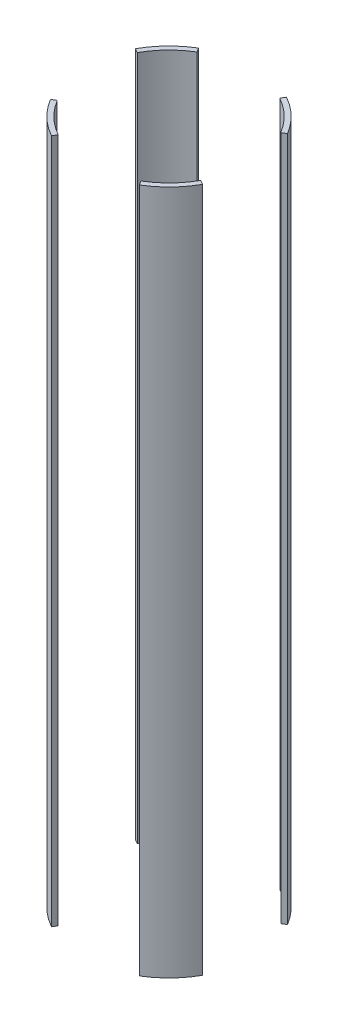
ISO-10303-21;
HEADER;
FILE_DESCRIPTION(('STEP AP214'),'2;1');
FILE_NAME('part.step','',(''),(''),'','','');
FILE_SCHEMA(('AUTOMOTIVE_DESIGN { 1 0 10303 214 1 1 1 1 }'));
ENDSEC;
DATA;
#1=APPLICATION_CONTEXT('core data for automotive mechanical design processes');
#2=APPLICATION_PROTOCOL_DEFINITION('international standard','automotive_design',2000,#1);
#3=PRODUCT_CONTEXT('',#1,'mechanical');
#4=PRODUCT('Part','Part','',(#3));
#5=PRODUCT_RELATED_PRODUCT_CATEGORY('part','',(#4));
#6=PRODUCT_DEFINITION_FORMATION('','',#4);
#7=PRODUCT_DEFINITION_CONTEXT('part definition',#1,'design');
#8=PRODUCT_DEFINITION('design','',#6,#7);
#9=PRODUCT_DEFINITION_SHAPE('','',#8);
#10=(LENGTH_UNIT() NAMED_UNIT(*) SI_UNIT(.MILLI.,.METRE.));
#11=(NAMED_UNIT(*) PLANE_ANGLE_UNIT() SI_UNIT($,.RADIAN.));
#12=(NAMED_UNIT(*) SI_UNIT($,.STERADIAN.) SOLID_ANGLE_UNIT());
#13=UNCERTAINTY_MEASURE_WITH_UNIT(LENGTH_MEASURE(1.E-05),#10,'distance_accuracy_value','');
#14=(GEOMETRIC_REPRESENTATION_CONTEXT(3) GLOBAL_UNCERTAINTY_ASSIGNED_CONTEXT((#13)) GLOBAL_UNIT_ASSIGNED_CONTEXT((#10,
#11,#12)) REPRESENTATION_CONTEXT('',''));
#15=CARTESIAN_POINT('',(0.,0.,0.));
#16=DIRECTION('',(0.,0.,1.));
#17=DIRECTION('',(1.,0.,0.));
#18=AXIS2_PLACEMENT_3D('',#15,#16,#17);
#19=CARTESIAN_POINT('',(0.,-352.425,0.));
#20=DIRECTION('',(0.,1.,0.));
#21=DIRECTION('',(0.,0.,1.));
#22=AXIS2_PLACEMENT_3D('',#19,#20,#21);
#23=PLANE('',#22);
#24=DIRECTION('',(0.48581550952375,0.,-0.874061376967418));
#25=VECTOR('',#24,1.);
#26=CARTESIAN_POINT('',(0.,-352.425,0.));
#27=LINE('',#26,#25);
#28=CARTESIAN_POINT('',(-43.1889987966614,-352.425,77.7040564124034));
#29=VERTEX_POINT('',#28);
#30=CARTESIAN_POINT('',(-40.7210560082808,-352.425,73.263824617409));
#31=VERTEX_POINT('',#30);
#32=EDGE_CURVE('E13',#29,#31,#27,.T.);
#33=ORIENTED_EDGE('',*,*,#32,.F.);
#34=CARTESIAN_POINT('',(0.,-352.425,0.));
#35=DIRECTION('',(0.,1.,0.));
#36=DIRECTION('',(0.,0.,1.));
#37=AXIS2_PLACEMENT_3D('',#34,#35,#36);
#38=CIRCLE('',#37,88.9);
#39=CARTESIAN_POINT('',(-76.2547983281261,-352.425,45.6991874319097));
#40=VERTEX_POINT('',#39);
#41=EDGE_CURVE('E276',#40,#29,#38,.T.);
#42=ORIENTED_EDGE('',*,*,#41,.F.);
#43=DIRECTION('',(0.857759261283758,0.,-0.514051602158714));
#44=VECTOR('',#43,1.);
#45=CARTESIAN_POINT('',(0.,-352.425,0.));
#46=LINE('',#45,#44);
#47=CARTESIAN_POINT('',(-71.8973812808046,-352.425,43.0878052929434));
#48=VERTEX_POINT('',#47);
#49=EDGE_CURVE('E271',#40,#48,#46,.T.);
#50=ORIENTED_EDGE('',*,*,#49,.T.);
#51=CARTESIAN_POINT('',(0.,-352.425,0.));
#52=DIRECTION('',(0.,1.,0.));
#53=DIRECTION('',(0.,0.,1.));
#54=AXIS2_PLACEMENT_3D('',#51,#52,#53);
#55=CIRCLE('',#54,83.82);
#56=EDGE_CURVE('E230',#48,#31,#55,.T.);
#57=ORIENTED_EDGE('',*,*,#56,.T.);
#58=EDGE_LOOP('',(#33,#42,#50,#57));
#59=FACE_BOUND('',#58,.T.);
#60=ADVANCED_FACE('F227',(#59),#23,.F.);
#61=CARTESIAN_POINT('',(0.,352.425,0.));
#62=DIRECTION('',(0.,1.,0.));
#63=DIRECTION('',(0.,0.,1.));
#64=AXIS2_PLACEMENT_3D('',#61,#62,#63);
#65=PLANE('',#64);
#66=CARTESIAN_POINT('',(0.,352.425,0.));
#67=DIRECTION('',(0.,1.,0.));
#68=DIRECTION('',(0.,0.,1.));
#69=AXIS2_PLACEMENT_3D('',#66,#67,#68);
#70=CIRCLE('',#69,88.9);
#71=CARTESIAN_POINT('',(-76.2547983281261,352.425,45.6991874319097));
#72=VERTEX_POINT('',#71);
#73=CARTESIAN_POINT('',(-43.1889987966614,352.425,77.7040564124034));
#74=VERTEX_POINT('',#73);
#75=EDGE_CURVE('E282',#72,#74,#70,.T.);
#76=ORIENTED_EDGE('',*,*,#75,.T.);
#77=DIRECTION('',(0.48581550952375,0.,-0.874061376967418));
#78=VECTOR('',#77,1.);
#79=CARTESIAN_POINT('',(0.,352.425,0.));
#80=LINE('',#79,#78);
#81=CARTESIAN_POINT('',(-40.7210560082808,352.425,73.263824617409));
#82=VERTEX_POINT('',#81);
#83=EDGE_CURVE('E243',#74,#82,#80,.T.);
#84=ORIENTED_EDGE('',*,*,#83,.T.);
#85=CARTESIAN_POINT('',(0.,352.425,0.));
#86=DIRECTION('',(0.,1.,0.));
#87=DIRECTION('',(0.,0.,1.));
#88=AXIS2_PLACEMENT_3D('',#85,#86,#87);
#89=CIRCLE('',#88,83.82);
#90=CARTESIAN_POINT('',(-71.8973812808046,352.425,43.0878052929434));
#91=VERTEX_POINT('',#90);
#92=EDGE_CURVE('E284',#91,#82,#89,.T.);
#93=ORIENTED_EDGE('',*,*,#92,.F.);
#94=DIRECTION('',(0.857759261283758,0.,-0.514051602158714));
#95=VECTOR('',#94,1.);
#96=CARTESIAN_POINT('',(0.,352.425,0.));
#97=LINE('',#96,#95);
#98=EDGE_CURVE('E268',#72,#91,#97,.T.);
#99=ORIENTED_EDGE('',*,*,#98,.F.);
#100=EDGE_LOOP('',(#76,#84,#93,#99));
#101=FACE_BOUND('',#100,.T.);
#102=ADVANCED_FACE('F281',(#101),#65,.T.);
#103=CARTESIAN_POINT('',(0.,352.425,0.));
#104=DIRECTION('',(0.,-1.,0.));
#105=DIRECTION('',(0.,0.,-1.));
#106=AXIS2_PLACEMENT_3D('',#103,#104,#105);
#107=CYLINDRICAL_SURFACE('',#106,88.9);
#108=DIRECTION('',(0.,-1.,0.));
#109=VECTOR('',#108,1.);
#110=CARTESIAN_POINT('',(-43.1889987966614,352.425,77.7040564124034));
#111=LINE('',#110,#109);
#112=EDGE_CURVE('E235',#74,#29,#111,.T.);
#113=ORIENTED_EDGE('',*,*,#112,.F.);
#114=ORIENTED_EDGE('',*,*,#75,.F.);
#115=DIRECTION('',(0.,-1.,0.));
#116=VECTOR('',#115,1.);
#117=CARTESIAN_POINT('',(-76.2547983281261,352.425,45.6991874319097));
#118=LINE('',#117,#116);
#119=EDGE_CURVE('E265',#72,#40,#118,.T.);
#120=ORIENTED_EDGE('',*,*,#119,.T.);
#121=ORIENTED_EDGE('',*,*,#41,.T.);
#122=EDGE_LOOP('',(#113,#114,#120,#121));
#123=FACE_BOUND('',#122,.T.);
#124=ADVANCED_FACE('F287',(#123),#107,.T.);
#125=CARTESIAN_POINT('',(0.,352.425,0.));
#126=DIRECTION('',(0.,-1.,0.));
#127=DIRECTION('',(0.,0.,-1.));
#128=AXIS2_PLACEMENT_3D('',#125,#126,#127);
#129=CYLINDRICAL_SURFACE('',#128,83.82);
#130=ORIENTED_EDGE('',*,*,#92,.T.);
#131=DIRECTION('',(0.,-1.,0.));
#132=VECTOR('',#131,1.);
#133=CARTESIAN_POINT('',(-40.7210560082807,352.425,73.2638246174089));
#134=LINE('',#133,#132);
#135=EDGE_CURVE('E247',#82,#31,#134,.T.);
#136=ORIENTED_EDGE('',*,*,#135,.T.);
#137=ORIENTED_EDGE('',*,*,#56,.F.);
#138=DIRECTION('',(0.,-1.,0.));
#139=VECTOR('',#138,1.);
#140=CARTESIAN_POINT('',(-71.8973812808046,352.425,43.0878052929434));
#141=LINE('',#140,#139);
#142=EDGE_CURVE('E285',#91,#48,#141,.T.);
#143=ORIENTED_EDGE('',*,*,#142,.F.);
#144=EDGE_LOOP('',(#130,#136,#137,#143));
#145=FACE_BOUND('',#144,.T.);
#146=ADVANCED_FACE('F301',(#145),#129,.F.);
#147=CARTESIAN_POINT('',(0.,-352.425,0.));
#148=DIRECTION('',(0.514051602158714,0.,0.857759261283758));
#149=DIRECTION('',(0.857759261283758,0.,-0.514051602158714));
#150=AXIS2_PLACEMENT_3D('',#147,#148,#149);
#151=PLANE('',#150);
#152=ORIENTED_EDGE('',*,*,#142,.T.);
#153=ORIENTED_EDGE('',*,*,#49,.F.);
#154=ORIENTED_EDGE('',*,*,#119,.F.);
#155=ORIENTED_EDGE('',*,*,#98,.T.);
#156=EDGE_LOOP('',(#152,#153,#154,#155));
#157=FACE_BOUND('',#156,.T.);
#158=ADVANCED_FACE('F267',(#157),#151,.F.);
#159=CARTESIAN_POINT('',(0.,-352.425,0.));
#160=DIRECTION('',(0.874061376967418,0.,0.48581550952375));
#161=DIRECTION('',(0.48581550952375,0.,-0.874061376967418));
#162=AXIS2_PLACEMENT_3D('',#159,#160,#161);
#163=PLANE('',#162);
#164=ORIENTED_EDGE('',*,*,#112,.T.);
#165=ORIENTED_EDGE('',*,*,#32,.T.);
#166=ORIENTED_EDGE('',*,*,#135,.F.);
#167=ORIENTED_EDGE('',*,*,#83,.F.);
#168=EDGE_LOOP('',(#164,#165,#166,#167));
#169=FACE_BOUND('',#168,.T.);
#170=ADVANCED_FACE('F299',(#169),#163,.T.);
#171=CLOSED_SHELL('',(#60,#102,#124,#146,#158,#170));
#172=MANIFOLD_SOLID_BREP('B2',#171);
#173=CARTESIAN_POINT('',(0.,352.425,0.));
#174=DIRECTION('',(0.,-1.,0.));
#175=DIRECTION('',(0.,0.,-1.));
#176=AXIS2_PLACEMENT_3D('',#173,#174,#175);
#177=CYLINDRICAL_SURFACE('',#176,83.82);
#178=DIRECTION('',(0.,-1.,0.));
#179=VECTOR('',#178,1.);
#180=CARTESIAN_POINT('',(-73.2638246174091,352.425,-40.7210560082805));
#181=LINE('',#180,#179);
#182=CARTESIAN_POINT('',(-73.2638246174091,-352.425,-40.7210560082805));
#183=VERTEX_POINT('',#182);
#184=CARTESIAN_POINT('',(-73.2638246174091,352.425,-40.7210560082805));
#185=VERTEX_POINT('',#184);
#186=EDGE_CURVE('E369',#183,#185,#181,.F.);
#187=ORIENTED_EDGE('',*,*,#186,.F.);
#188=CARTESIAN_POINT('',(0.,-352.425,0.));
#189=DIRECTION('',(0.,1.,0.));
#190=DIRECTION('',(0.,0.,1.));
#191=AXIS2_PLACEMENT_3D('',#188,#189,#190);
#192=CIRCLE('',#191,83.82);
#193=CARTESIAN_POINT('',(-43.0878052929431,-352.425,-71.8973812808048));
#194=VERTEX_POINT('',#193);
#195=EDGE_CURVE('E363',#194,#183,#192,.T.);
#196=ORIENTED_EDGE('',*,*,#195,.F.);
#197=DIRECTION('',(0.,-1.,0.));
#198=VECTOR('',#197,1.);
#199=CARTESIAN_POINT('',(-43.0878052929431,352.425,-71.8973812808048));
#200=LINE('',#199,#198);
#201=CARTESIAN_POINT('',(-43.0878052929431,352.425,-71.8973812808048));
#202=VERTEX_POINT('',#201);
#203=EDGE_CURVE('E417',#202,#194,#200,.T.);
#204=ORIENTED_EDGE('',*,*,#203,.F.);
#205=CARTESIAN_POINT('',(0.,352.425,0.));
#206=DIRECTION('',(0.,1.,0.));
#207=DIRECTION('',(0.,0.,1.));
#208=AXIS2_PLACEMENT_3D('',#205,#206,#207);
#209=CIRCLE('',#208,83.82);
#210=EDGE_CURVE('E423',#202,#185,#209,.T.);
#211=ORIENTED_EDGE('',*,*,#210,.T.);
#212=EDGE_LOOP('',(#187,#196,#204,#211));
#213=FACE_BOUND('',#212,.T.);
#214=ADVANCED_FACE('F360',(#213),#177,.F.);
#215=CARTESIAN_POINT('',(0.,352.425,0.));
#216=DIRECTION('',(0.,-1.,0.));
#217=DIRECTION('',(0.,0.,-1.));
#218=AXIS2_PLACEMENT_3D('',#215,#216,#217);
#219=CYLINDRICAL_SURFACE('',#218,88.9);
#220=CARTESIAN_POINT('',(0.,-352.425,0.));
#221=DIRECTION('',(0.,1.,0.));
#222=DIRECTION('',(0.,0.,1.));
#223=AXIS2_PLACEMENT_3D('',#220,#221,#222);
#224=CIRCLE('',#223,88.9);
#225=CARTESIAN_POINT('',(-45.6991874319094,-352.425,-76.2547983281263));
#226=VERTEX_POINT('',#225);
#227=CARTESIAN_POINT('',(-77.7040564124036,-352.425,-43.1889987966612));
#228=VERTEX_POINT('',#227);
#229=EDGE_CURVE('E409',#226,#228,#224,.T.);
#230=ORIENTED_EDGE('',*,*,#229,.T.);
#231=DIRECTION('',(0.,-1.,0.));
#232=VECTOR('',#231,1.);
#233=CARTESIAN_POINT('',(-77.7040564124036,352.425,-43.1889987966611));
#234=LINE('',#233,#232);
#235=CARTESIAN_POINT('',(-77.7040564124036,352.425,-43.1889987966612));
#236=VERTEX_POINT('',#235);
#237=EDGE_CURVE('E397',#228,#236,#234,.F.);
#238=ORIENTED_EDGE('',*,*,#237,.T.);
#239=CARTESIAN_POINT('',(0.,352.425,0.));
#240=DIRECTION('',(0.,1.,0.));
#241=DIRECTION('',(0.,0.,1.));
#242=AXIS2_PLACEMENT_3D('',#239,#240,#241);
#243=CIRCLE('',#242,88.9);
#244=CARTESIAN_POINT('',(-45.6991874319094,352.425,-76.2547983281263));
#245=VERTEX_POINT('',#244);
#246=EDGE_CURVE('E407',#245,#236,#243,.T.);
#247=ORIENTED_EDGE('',*,*,#246,.F.);
#248=DIRECTION('',(0.,-1.,0.));
#249=VECTOR('',#248,1.);
#250=CARTESIAN_POINT('',(-45.6991874319094,352.425,-76.2547983281263));
#251=LINE('',#250,#249);
#252=EDGE_CURVE('E410',#245,#226,#251,.T.);
#253=ORIENTED_EDGE('',*,*,#252,.T.);
#254=EDGE_LOOP('',(#230,#238,#247,#253));
#255=FACE_BOUND('',#254,.T.);
#256=ADVANCED_FACE('F405',(#255),#219,.T.);
#257=CARTESIAN_POINT('',(0.,-352.425,0.));
#258=DIRECTION('',(0.,1.,0.));
#259=DIRECTION('',(0.,0.,1.));
#260=AXIS2_PLACEMENT_3D('',#257,#258,#259);
#261=PLANE('',#260);
#262=ORIENTED_EDGE('',*,*,#195,.T.);
#263=DIRECTION('',(-0.87406137696742,0.,-0.485815509523748));
#264=VECTOR('',#263,1.);
#265=CARTESIAN_POINT('',(0.,-352.425,0.));
#266=LINE('',#265,#264);
#267=EDGE_CURVE('E377',#183,#228,#266,.T.);
#268=ORIENTED_EDGE('',*,*,#267,.T.);
#269=ORIENTED_EDGE('',*,*,#229,.F.);
#270=DIRECTION('',(0.514051602158711,0.,0.85775926128376));
#271=VECTOR('',#270,1.);
#272=CARTESIAN_POINT('',(0.,-352.425,0.));
#273=LINE('',#272,#271);
#274=EDGE_CURVE('E415',#226,#194,#273,.T.);
#275=ORIENTED_EDGE('',*,*,#274,.T.);
#276=EDGE_LOOP('',(#262,#268,#269,#275));
#277=FACE_BOUND('',#276,.T.);
#278=ADVANCED_FACE('F433',(#277),#261,.F.);
#279=CARTESIAN_POINT('',(0.,352.425,0.));
#280=DIRECTION('',(0.,1.,0.));
#281=DIRECTION('',(0.,0.,1.));
#282=AXIS2_PLACEMENT_3D('',#279,#280,#281);
#283=PLANE('',#282);
#284=DIRECTION('',(-0.87406137696742,0.,-0.485815509523748));
#285=VECTOR('',#284,1.);
#286=CARTESIAN_POINT('',(0.,352.425,0.));
#287=LINE('',#286,#285);
#288=EDGE_CURVE('E225',#185,#236,#287,.T.);
#289=ORIENTED_EDGE('',*,*,#288,.F.);
#290=ORIENTED_EDGE('',*,*,#210,.F.);
#291=DIRECTION('',(0.514051602158711,0.,0.85775926128376));
#292=VECTOR('',#291,1.);
#293=CARTESIAN_POINT('',(0.,352.425,0.));
#294=LINE('',#293,#292);
#295=EDGE_CURVE('E414',#245,#202,#294,.T.);
#296=ORIENTED_EDGE('',*,*,#295,.F.);
#297=ORIENTED_EDGE('',*,*,#246,.T.);
#298=EDGE_LOOP('',(#289,#290,#296,#297));
#299=FACE_BOUND('',#298,.T.);
#300=ADVANCED_FACE('F413',(#299),#283,.T.);
#301=CARTESIAN_POINT('',(0.,-352.425,0.));
#302=DIRECTION('',(-0.85775926128376,0.,0.514051602158711));
#303=DIRECTION('',(0.514051602158711,0.,0.85775926128376));
#304=AXIS2_PLACEMENT_3D('',#301,#302,#303);
#305=PLANE('',#304);
#306=ORIENTED_EDGE('',*,*,#295,.T.);
#307=ORIENTED_EDGE('',*,*,#203,.T.);
#308=ORIENTED_EDGE('',*,*,#274,.F.);
#309=ORIENTED_EDGE('',*,*,#252,.F.);
#310=EDGE_LOOP('',(#306,#307,#308,#309));
#311=FACE_BOUND('',#310,.T.);
#312=ADVANCED_FACE('F434',(#311),#305,.F.);
#313=CARTESIAN_POINT('',(0.,-352.425,0.));
#314=DIRECTION('',(0.485815509523747,0.,-0.87406137696742));
#315=DIRECTION('',(-0.87406137696742,0.,-0.485815509523748));
#316=AXIS2_PLACEMENT_3D('',#313,#314,#315);
#317=PLANE('',#316);
#318=ORIENTED_EDGE('',*,*,#186,.T.);
#319=ORIENTED_EDGE('',*,*,#288,.T.);
#320=ORIENTED_EDGE('',*,*,#237,.F.);
#321=ORIENTED_EDGE('',*,*,#267,.F.);
#322=EDGE_LOOP('',(#318,#319,#320,#321));
#323=FACE_BOUND('',#322,.T.);
#324=ADVANCED_FACE('F396',(#323),#317,.F.);
#325=CLOSED_SHELL('',(#214,#256,#278,#300,#312,#324));
#326=MANIFOLD_SOLID_BREP('B7',#325);
#327=CARTESIAN_POINT('',(0.,352.425,0.));
#328=DIRECTION('',(0.,1.,0.));
#329=DIRECTION('',(0.,0.,1.));
#330=AXIS2_PLACEMENT_3D('',#327,#328,#329);
#331=PLANE('',#330);
#332=DIRECTION('',(0.485815509523751,0.,-0.874061376967418));
#333=VECTOR('',#332,1.);
#334=CARTESIAN_POINT('',(0.,352.425,0.));
#335=LINE('',#334,#333);
#336=CARTESIAN_POINT('',(40.7210560082808,352.425,-73.2638246174089));
#337=VERTEX_POINT('',#336);
#338=CARTESIAN_POINT('',(43.1889987966614,352.425,-77.7040564124034));
#339=VERTEX_POINT('',#338);
#340=EDGE_CURVE('E358',#337,#339,#335,.T.);
#341=ORIENTED_EDGE('',*,*,#340,.F.);
#342=CARTESIAN_POINT('',(0.,352.425,0.));
#343=DIRECTION('',(0.,1.,0.));
#344=DIRECTION('',(0.,0.,1.));
#345=AXIS2_PLACEMENT_3D('',#342,#343,#344);
#346=CIRCLE('',#345,83.82);
#347=CARTESIAN_POINT('',(71.8973812808046,352.425,-43.0878052929434));
#348=VERTEX_POINT('',#347);
#349=EDGE_CURVE('E540',#348,#337,#346,.T.);
#350=ORIENTED_EDGE('',*,*,#349,.F.);
#351=DIRECTION('',(0.857759261283759,0.,-0.514051602158714));
#352=VECTOR('',#351,1.);
#353=CARTESIAN_POINT('',(0.,352.425,0.));
#354=LINE('',#353,#352);
#355=CARTESIAN_POINT('',(76.2547983281261,352.425,-45.6991874319097));
#356=VERTEX_POINT('',#355);
#357=EDGE_CURVE('E553',#348,#356,#354,.T.);
#358=ORIENTED_EDGE('',*,*,#357,.T.);
#359=CARTESIAN_POINT('',(0.,352.425,0.));
#360=DIRECTION('',(0.,1.,0.));
#361=DIRECTION('',(0.,0.,1.));
#362=AXIS2_PLACEMENT_3D('',#359,#360,#361);
#363=CIRCLE('',#362,88.9);
#364=EDGE_CURVE('E542',#356,#339,#363,.T.);
#365=ORIENTED_EDGE('',*,*,#364,.T.);
#366=EDGE_LOOP('',(#341,#350,#358,#365));
#367=FACE_BOUND('',#366,.T.);
#368=ADVANCED_FACE('F492',(#367),#331,.T.);
#369=CARTESIAN_POINT('',(0.,-352.425,0.));
#370=DIRECTION('',(0.,1.,0.));
#371=DIRECTION('',(0.,0.,1.));
#372=AXIS2_PLACEMENT_3D('',#369,#370,#371);
#373=PLANE('',#372);
#374=CARTESIAN_POINT('',(0.,-352.425,0.));
#375=DIRECTION('',(0.,1.,0.));
#376=DIRECTION('',(0.,0.,1.));
#377=AXIS2_PLACEMENT_3D('',#374,#375,#376);
#378=CIRCLE('',#377,83.82);
#379=CARTESIAN_POINT('',(71.8973812808046,-352.425,-43.0878052929434));
#380=VERTEX_POINT('',#379);
#381=CARTESIAN_POINT('',(40.7210560082808,-352.425,-73.2638246174089));
#382=VERTEX_POINT('',#381);
#383=EDGE_CURVE('E495',#380,#382,#378,.T.);
#384=ORIENTED_EDGE('',*,*,#383,.T.);
#385=DIRECTION('',(0.485815509523751,0.,-0.874061376967418));
#386=VECTOR('',#385,1.);
#387=CARTESIAN_POINT('',(0.,-352.425,0.));
#388=LINE('',#387,#386);
#389=CARTESIAN_POINT('',(43.1889987966614,-352.425,-77.7040564124034));
#390=VERTEX_POINT('',#389);
#391=EDGE_CURVE('E526',#382,#390,#388,.T.);
#392=ORIENTED_EDGE('',*,*,#391,.T.);
#393=CARTESIAN_POINT('',(0.,-352.425,0.));
#394=DIRECTION('',(0.,1.,0.));
#395=DIRECTION('',(0.,0.,1.));
#396=AXIS2_PLACEMENT_3D('',#393,#394,#395);
#397=CIRCLE('',#396,88.9);
#398=CARTESIAN_POINT('',(76.2547983281261,-352.425,-45.6991874319097));
#399=VERTEX_POINT('',#398);
#400=EDGE_CURVE('E550',#399,#390,#397,.T.);
#401=ORIENTED_EDGE('',*,*,#400,.F.);
#402=DIRECTION('',(0.857759261283759,0.,-0.514051602158714));
#403=VECTOR('',#402,1.);
#404=CARTESIAN_POINT('',(0.,-352.425,0.));
#405=LINE('',#404,#403);
#406=EDGE_CURVE('E534',#380,#399,#405,.T.);
#407=ORIENTED_EDGE('',*,*,#406,.F.);
#408=EDGE_LOOP('',(#384,#392,#401,#407));
#409=FACE_BOUND('',#408,.T.);
#410=ADVANCED_FACE('F566',(#409),#373,.F.);
#411=CARTESIAN_POINT('',(0.,352.425,0.));
#412=DIRECTION('',(0.,-1.,0.));
#413=DIRECTION('',(0.,0.,-1.));
#414=AXIS2_PLACEMENT_3D('',#411,#412,#413);
#415=CYLINDRICAL_SURFACE('',#414,88.9);
#416=ORIENTED_EDGE('',*,*,#400,.T.);
#417=DIRECTION('',(0.,-1.,0.));
#418=VECTOR('',#417,1.);
#419=CARTESIAN_POINT('',(43.1889987966614,352.425,-77.7040564124034));
#420=LINE('',#419,#418);
#421=EDGE_CURVE('E509',#390,#339,#420,.F.);
#422=ORIENTED_EDGE('',*,*,#421,.T.);
#423=ORIENTED_EDGE('',*,*,#364,.F.);
#424=DIRECTION('',(0.,-1.,0.));
#425=VECTOR('',#424,1.);
#426=CARTESIAN_POINT('',(76.2547983281261,352.425,-45.6991874319097));
#427=LINE('',#426,#425);
#428=EDGE_CURVE('E546',#399,#356,#427,.F.);
#429=ORIENTED_EDGE('',*,*,#428,.F.);
#430=EDGE_LOOP('',(#416,#422,#423,#429));
#431=FACE_BOUND('',#430,.T.);
#432=ADVANCED_FACE('F565',(#431),#415,.T.);
#433=CARTESIAN_POINT('',(0.,352.425,0.));
#434=DIRECTION('',(0.,-1.,0.));
#435=DIRECTION('',(0.,0.,-1.));
#436=AXIS2_PLACEMENT_3D('',#433,#434,#435);
#437=CYLINDRICAL_SURFACE('',#436,83.82);
#438=DIRECTION('',(0.,-1.,0.));
#439=VECTOR('',#438,1.);
#440=CARTESIAN_POINT('',(40.7210560082808,352.425,-73.2638246174089));
#441=LINE('',#440,#439);
#442=EDGE_CURVE('E501',#382,#337,#441,.F.);
#443=ORIENTED_EDGE('',*,*,#442,.F.);
#444=ORIENTED_EDGE('',*,*,#383,.F.);
#445=DIRECTION('',(0.,-1.,0.));
#446=VECTOR('',#445,1.);
#447=CARTESIAN_POINT('',(71.8973812808046,352.425,-43.0878052929434));
#448=LINE('',#447,#446);
#449=EDGE_CURVE('E545',#380,#348,#448,.F.);
#450=ORIENTED_EDGE('',*,*,#449,.T.);
#451=ORIENTED_EDGE('',*,*,#349,.T.);
#452=EDGE_LOOP('',(#443,#444,#450,#451));
#453=FACE_BOUND('',#452,.T.);
#454=ADVANCED_FACE('F544',(#453),#437,.F.);
#455=CARTESIAN_POINT('',(0.,-352.425,0.));
#456=DIRECTION('',(0.514051602158714,0.,0.857759261283758));
#457=DIRECTION('',(0.857759261283759,0.,-0.514051602158714));
#458=AXIS2_PLACEMENT_3D('',#455,#456,#457);
#459=PLANE('',#458);
#460=ORIENTED_EDGE('',*,*,#428,.T.);
#461=ORIENTED_EDGE('',*,*,#357,.F.);
#462=ORIENTED_EDGE('',*,*,#449,.F.);
#463=ORIENTED_EDGE('',*,*,#406,.T.);
#464=EDGE_LOOP('',(#460,#461,#462,#463));
#465=FACE_BOUND('',#464,.T.);
#466=ADVANCED_FACE('F561',(#465),#459,.T.);
#467=CARTESIAN_POINT('',(0.,-352.425,0.));
#468=DIRECTION('',(0.874061376967418,0.,0.485815509523751));
#469=DIRECTION('',(0.485815509523751,0.,-0.874061376967418));
#470=AXIS2_PLACEMENT_3D('',#467,#468,#469);
#471=PLANE('',#470);
#472=ORIENTED_EDGE('',*,*,#391,.F.);
#473=ORIENTED_EDGE('',*,*,#442,.T.);
#474=ORIENTED_EDGE('',*,*,#340,.T.);
#475=ORIENTED_EDGE('',*,*,#421,.F.);
#476=EDGE_LOOP('',(#472,#473,#474,#475));
#477=FACE_BOUND('',#476,.T.);
#478=ADVANCED_FACE('F529',(#477),#471,.F.);
#479=CLOSED_SHELL('',(#368,#410,#432,#454,#466,#478));
#480=MANIFOLD_SOLID_BREP('B219',#479);
#481=CARTESIAN_POINT('',(0.,-352.425,0.));
#482=DIRECTION('',(0.485815509523748,0.,-0.874061376967419));
#483=DIRECTION('',(-0.87406137696742,0.,-0.485815509523748));
#484=AXIS2_PLACEMENT_3D('',#481,#482,#483);
#485=PLANE('',#484);
#486=DIRECTION('',(0.,-1.,0.));
#487=VECTOR('',#486,1.);
#488=CARTESIAN_POINT('',(77.7040564124036,352.425,43.1889987966611));
#489=LINE('',#488,#487);
#490=CARTESIAN_POINT('',(77.7040564124036,352.425,43.1889987966612));
#491=VERTEX_POINT('',#490);
#492=CARTESIAN_POINT('',(77.7040564124036,-352.425,43.1889987966612));
#493=VERTEX_POINT('',#492);
#494=EDGE_CURVE('E673',#491,#493,#489,.T.);
#495=ORIENTED_EDGE('',*,*,#494,.T.);
#496=DIRECTION('',(-0.87406137696742,0.,-0.485815509523748));
#497=VECTOR('',#496,1.);
#498=CARTESIAN_POINT('',(0.,-352.425,0.));
#499=LINE('',#498,#497);
#500=CARTESIAN_POINT('',(73.2638246174091,-352.425,40.7210560082805));
#501=VERTEX_POINT('',#500);
#502=EDGE_CURVE('E682',#493,#501,#499,.T.);
#503=ORIENTED_EDGE('',*,*,#502,.T.);
#504=DIRECTION('',(0.,-1.,0.));
#505=VECTOR('',#504,1.);
#506=CARTESIAN_POINT('',(73.2638246174091,352.425,40.7210560082805));
#507=LINE('',#506,#505);
#508=CARTESIAN_POINT('',(73.2638246174091,352.425,40.7210560082805));
#509=VERTEX_POINT('',#508);
#510=EDGE_CURVE('E623',#509,#501,#507,.T.);
#511=ORIENTED_EDGE('',*,*,#510,.F.);
#512=DIRECTION('',(-0.87406137696742,0.,-0.485815509523748));
#513=VECTOR('',#512,1.);
#514=CARTESIAN_POINT('',(0.,352.425,0.));
#515=LINE('',#514,#513);
#516=EDGE_CURVE('E661',#491,#509,#515,.T.);
#517=ORIENTED_EDGE('',*,*,#516,.F.);
#518=EDGE_LOOP('',(#495,#503,#511,#517));
#519=FACE_BOUND('',#518,.T.);
#520=ADVANCED_FACE('F615',(#519),#485,.T.);
#521=CARTESIAN_POINT('',(0.,352.425,0.));
#522=DIRECTION('',(0.,-1.,0.));
#523=DIRECTION('',(0.,0.,-1.));
#524=AXIS2_PLACEMENT_3D('',#521,#522,#523);
#525=CYLINDRICAL_SURFACE('',#524,88.9);
#526=DIRECTION('',(0.,-1.,0.));
#527=VECTOR('',#526,1.);
#528=CARTESIAN_POINT('',(45.6991874319094,352.425,76.2547983281262));
#529=LINE('',#528,#527);
#530=CARTESIAN_POINT('',(45.6991874319095,-352.425,76.2547983281263));
#531=VERTEX_POINT('',#530);
#532=CARTESIAN_POINT('',(45.6991874319095,352.425,76.2547983281263));
#533=VERTEX_POINT('',#532);
#534=EDGE_CURVE('E655',#531,#533,#529,.F.);
#535=ORIENTED_EDGE('',*,*,#534,.F.);
#536=CARTESIAN_POINT('',(0.,-352.425,0.));
#537=DIRECTION('',(0.,1.,0.));
#538=DIRECTION('',(0.,0.,1.));
#539=AXIS2_PLACEMENT_3D('',#536,#537,#538);
#540=CIRCLE('',#539,88.9);
#541=EDGE_CURVE('E674',#531,#493,#540,.T.);
#542=ORIENTED_EDGE('',*,*,#541,.T.);
#543=ORIENTED_EDGE('',*,*,#494,.F.);
#544=CARTESIAN_POINT('',(0.,352.425,0.));
#545=DIRECTION('',(0.,1.,0.));
#546=DIRECTION('',(0.,0.,1.));
#547=AXIS2_PLACEMENT_3D('',#544,#545,#546);
#548=CIRCLE('',#547,88.9);
#549=EDGE_CURVE('E667',#533,#491,#548,.T.);
#550=ORIENTED_EDGE('',*,*,#549,.F.);
#551=EDGE_LOOP('',(#535,#542,#543,#550));
#552=FACE_BOUND('',#551,.T.);
#553=ADVANCED_FACE('F617',(#552),#525,.T.);
#554=CARTESIAN_POINT('',(0.,352.425,0.));
#555=DIRECTION('',(0.,-1.,0.));
#556=DIRECTION('',(0.,0.,-1.));
#557=AXIS2_PLACEMENT_3D('',#554,#555,#556);
#558=CYLINDRICAL_SURFACE('',#557,83.82);
#559=CARTESIAN_POINT('',(0.,-352.425,0.));
#560=DIRECTION('',(0.,1.,0.));
#561=DIRECTION('',(0.,0.,1.));
#562=AXIS2_PLACEMENT_3D('',#559,#560,#561);
#563=CIRCLE('',#562,83.82);
#564=CARTESIAN_POINT('',(43.0878052929432,-352.425,71.8973812808048));
#565=VERTEX_POINT('',#564);
#566=EDGE_CURVE('E637',#565,#501,#563,.T.);
#567=ORIENTED_EDGE('',*,*,#566,.F.);
#568=DIRECTION('',(0.,-1.,0.));
#569=VECTOR('',#568,1.);
#570=CARTESIAN_POINT('',(43.0878052929432,352.425,71.8973812808048));
#571=LINE('',#570,#569);
#572=CARTESIAN_POINT('',(43.0878052929432,352.425,71.8973812808048));
#573=VERTEX_POINT('',#572);
#574=EDGE_CURVE('E490',#565,#573,#571,.F.);
#575=ORIENTED_EDGE('',*,*,#574,.T.);
#576=CARTESIAN_POINT('',(0.,352.425,0.));
#577=DIRECTION('',(0.,1.,0.));
#578=DIRECTION('',(0.,0.,1.));
#579=AXIS2_PLACEMENT_3D('',#576,#577,#578);
#580=CIRCLE('',#579,83.82);
#581=EDGE_CURVE('E669',#573,#509,#580,.T.);
#582=ORIENTED_EDGE('',*,*,#581,.T.);
#583=ORIENTED_EDGE('',*,*,#510,.T.);
#584=EDGE_LOOP('',(#567,#575,#582,#583));
#585=FACE_BOUND('',#584,.T.);
#586=ADVANCED_FACE('F688',(#585),#558,.F.);
#587=CARTESIAN_POINT('',(0.,352.425,0.));
#588=DIRECTION('',(0.,1.,0.));
#589=DIRECTION('',(0.,0.,1.));
#590=AXIS2_PLACEMENT_3D('',#587,#588,#589);
#591=PLANE('',#590);
#592=ORIENTED_EDGE('',*,*,#581,.F.);
#593=DIRECTION('',(0.514051602158711,0.,0.85775926128376));
#594=VECTOR('',#593,1.);
#595=CARTESIAN_POINT('',(0.,352.425,0.));
#596=LINE('',#595,#594);
#597=EDGE_CURVE('E630',#573,#533,#596,.T.);
#598=ORIENTED_EDGE('',*,*,#597,.T.);
#599=ORIENTED_EDGE('',*,*,#549,.T.);
#600=ORIENTED_EDGE('',*,*,#516,.T.);
#601=EDGE_LOOP('',(#592,#598,#599,#600));
#602=FACE_BOUND('',#601,.T.);
#603=ADVANCED_FACE('F665',(#602),#591,.T.);
#604=CARTESIAN_POINT('',(0.,-352.425,0.));
#605=DIRECTION('',(0.,1.,0.));
#606=DIRECTION('',(0.,0.,1.));
#607=AXIS2_PLACEMENT_3D('',#604,#605,#606);
#608=PLANE('',#607);
#609=DIRECTION('',(0.514051602158711,0.,0.85775926128376));
#610=VECTOR('',#609,1.);
#611=CARTESIAN_POINT('',(0.,-352.425,0.));
#612=LINE('',#611,#610);
#613=EDGE_CURVE('E657',#565,#531,#612,.T.);
#614=ORIENTED_EDGE('',*,*,#613,.F.);
#615=ORIENTED_EDGE('',*,*,#566,.T.);
#616=ORIENTED_EDGE('',*,*,#502,.F.);
#617=ORIENTED_EDGE('',*,*,#541,.F.);
#618=EDGE_LOOP('',(#614,#615,#616,#617));
#619=FACE_BOUND('',#618,.T.);
#620=ADVANCED_FACE('F689',(#619),#608,.F.);
#621=CARTESIAN_POINT('',(0.,-352.425,0.));
#622=DIRECTION('',(-0.85775926128376,0.,0.514051602158711));
#623=DIRECTION('',(0.514051602158711,0.,0.85775926128376));
#624=AXIS2_PLACEMENT_3D('',#621,#622,#623);
#625=PLANE('',#624);
#626=ORIENTED_EDGE('',*,*,#534,.T.);
#627=ORIENTED_EDGE('',*,*,#597,.F.);
#628=ORIENTED_EDGE('',*,*,#574,.F.);
#629=ORIENTED_EDGE('',*,*,#613,.T.);
#630=EDGE_LOOP('',(#626,#627,#628,#629));
#631=FACE_BOUND('',#630,.T.);
#632=ADVANCED_FACE('F656',(#631),#625,.T.);
#633=CLOSED_SHELL('',(#520,#553,#586,#603,#620,#632));
#634=MANIFOLD_SOLID_BREP('B352',#633);
#635=ADVANCED_BREP_SHAPE_REPRESENTATION('',(#18,#172,#326,#480,#634),#14);
#636=SHAPE_DEFINITION_REPRESENTATION(#9,#635);
ENDSEC;
END-ISO-10303-21;
